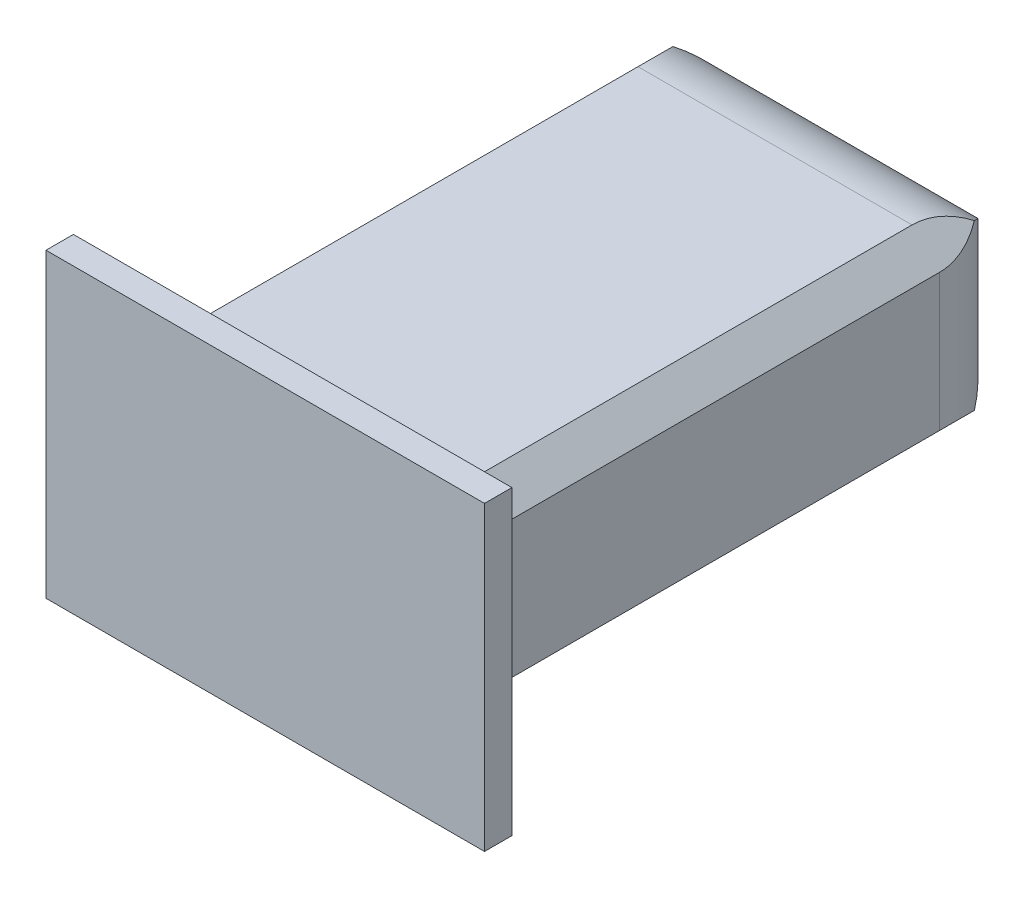
ISO-10303-21;
HEADER;
FILE_DESCRIPTION(('STEP AP214'),'2;1');
FILE_NAME('part.step','',(''),(''),'','','');
FILE_SCHEMA(('AUTOMOTIVE_DESIGN { 1 0 10303 214 1 1 1 1 }'));
ENDSEC;
DATA;
#1=APPLICATION_CONTEXT('core data for automotive mechanical design processes');
#2=APPLICATION_PROTOCOL_DEFINITION('international standard','automotive_design',2000,#1);
#3=PRODUCT_CONTEXT('',#1,'mechanical');
#4=PRODUCT('Part','Part','',(#3));
#5=PRODUCT_RELATED_PRODUCT_CATEGORY('part','',(#4));
#6=PRODUCT_DEFINITION_FORMATION('','',#4);
#7=PRODUCT_DEFINITION_CONTEXT('part definition',#1,'design');
#8=PRODUCT_DEFINITION('design','',#6,#7);
#9=PRODUCT_DEFINITION_SHAPE('','',#8);
#10=(LENGTH_UNIT() NAMED_UNIT(*) SI_UNIT(.MILLI.,.METRE.));
#11=(NAMED_UNIT(*) PLANE_ANGLE_UNIT() SI_UNIT($,.RADIAN.));
#12=(NAMED_UNIT(*) SI_UNIT($,.STERADIAN.) SOLID_ANGLE_UNIT());
#13=UNCERTAINTY_MEASURE_WITH_UNIT(LENGTH_MEASURE(1.E-05),#10,'distance_accuracy_value','');
#14=(GEOMETRIC_REPRESENTATION_CONTEXT(3) GLOBAL_UNCERTAINTY_ASSIGNED_CONTEXT((#13)) GLOBAL_UNIT_ASSIGNED_CONTEXT((#10,
#11,#12)) REPRESENTATION_CONTEXT('',''));
#15=CARTESIAN_POINT('',(0.,0.,0.));
#16=DIRECTION('',(0.,0.,1.));
#17=DIRECTION('',(1.,0.,0.));
#18=AXIS2_PLACEMENT_3D('',#15,#16,#17);
#19=CARTESIAN_POINT('',(1.5,0.875000000000001,5.));
#20=DIRECTION('',(-1.,0.,0.));
#21=DIRECTION('',(0.,0.,1.));
#22=AXIS2_PLACEMENT_3D('',#19,#20,#21);
#23=PLANE('',#22);
#24=DIRECTION('',(0.,0.,-1.));
#25=VECTOR('',#24,1.);
#26=CARTESIAN_POINT('',(1.5,-0.625000000000001,5.));
#27=LINE('',#26,#25);
#28=CARTESIAN_POINT('',(1.5,-0.625000000000001,5.));
#29=VERTEX_POINT('',#28);
#30=CARTESIAN_POINT('',(1.5,-0.625000000000001,0.85));
#31=VERTEX_POINT('',#30);
#32=EDGE_CURVE('E250',#29,#31,#27,.T.);
#33=ORIENTED_EDGE('',*,*,#32,.T.);
#34=DIRECTION('',(0.,1.,0.));
#35=VECTOR('',#34,1.);
#36=CARTESIAN_POINT('',(1.5,0.875000000000001,0.85));
#37=LINE('',#36,#35);
#38=CARTESIAN_POINT('',(1.5,0.625000000000001,0.85));
#39=VERTEX_POINT('',#38);
#40=EDGE_CURVE('E290',#31,#39,#37,.T.);
#41=ORIENTED_EDGE('',*,*,#40,.T.);
#42=DIRECTION('',(0.,0.,1.));
#43=VECTOR('',#42,1.);
#44=CARTESIAN_POINT('',(1.5,0.625000000000001,5.));
#45=LINE('',#44,#43);
#46=CARTESIAN_POINT('',(1.5,0.625000000000001,5.));
#47=VERTEX_POINT('',#46);
#48=EDGE_CURVE('E247',#39,#47,#45,.T.);
#49=ORIENTED_EDGE('',*,*,#48,.T.);
#50=DIRECTION('',(0.,1.,0.));
#51=VECTOR('',#50,1.);
#52=CARTESIAN_POINT('',(1.5,0.875000000000001,5.));
#53=LINE('',#52,#51);
#54=EDGE_CURVE('E205',#29,#47,#53,.T.);
#55=ORIENTED_EDGE('',*,*,#54,.F.);
#56=EDGE_LOOP('',(#33,#41,#49,#55));
#57=FACE_BOUND('',#56,.T.);
#58=ADVANCED_FACE('F49',(#57),#23,.F.);
#59=CARTESIAN_POINT('',(-1.5,0.875000000000001,5.));
#60=DIRECTION('',(0.,-1.,0.));
#61=DIRECTION('',(0.,0.,-1.));
#62=AXIS2_PLACEMENT_3D('',#59,#60,#61);
#63=PLANE('',#62);
#64=DIRECTION('',(0.,0.,-1.));
#65=VECTOR('',#64,1.);
#66=CARTESIAN_POINT('',(1.25,0.875000000000001,5.));
#67=LINE('',#66,#65);
#68=CARTESIAN_POINT('',(1.25,0.875000000000001,5.));
#69=VERTEX_POINT('',#68);
#70=CARTESIAN_POINT('',(1.25,0.875000000000001,0.85));
#71=VERTEX_POINT('',#70);
#72=EDGE_CURVE('E240',#69,#71,#67,.T.);
#73=ORIENTED_EDGE('',*,*,#72,.T.);
#74=DIRECTION('',(-1.,0.,0.));
#75=VECTOR('',#74,1.);
#76=CARTESIAN_POINT('',(-1.5,0.875000000000001,0.85));
#77=LINE('',#76,#75);
#78=CARTESIAN_POINT('',(-1.25,0.875000000000001,0.85));
#79=VERTEX_POINT('',#78);
#80=EDGE_CURVE('E332',#71,#79,#77,.T.);
#81=ORIENTED_EDGE('',*,*,#80,.T.);
#82=DIRECTION('',(0.,0.,1.));
#83=VECTOR('',#82,1.);
#84=CARTESIAN_POINT('',(-1.25,0.875000000000001,5.));
#85=LINE('',#84,#83);
#86=CARTESIAN_POINT('',(-1.25,0.875000000000001,5.));
#87=VERTEX_POINT('',#86);
#88=EDGE_CURVE('E244',#79,#87,#85,.T.);
#89=ORIENTED_EDGE('',*,*,#88,.T.);
#90=DIRECTION('',(-1.,0.,0.));
#91=VECTOR('',#90,1.);
#92=CARTESIAN_POINT('',(-1.5,0.875000000000001,5.));
#93=LINE('',#92,#91);
#94=EDGE_CURVE('E210',#69,#87,#93,.T.);
#95=ORIENTED_EDGE('',*,*,#94,.F.);
#96=EDGE_LOOP('',(#73,#81,#89,#95));
#97=FACE_BOUND('',#96,.T.);
#98=ADVANCED_FACE('F389',(#97),#63,.F.);
#99=CARTESIAN_POINT('',(-1.5,0.875000000000001,5.));
#100=DIRECTION('',(1.,0.,0.));
#101=DIRECTION('',(0.,0.,-1.));
#102=AXIS2_PLACEMENT_3D('',#99,#100,#101);
#103=PLANE('',#102);
#104=DIRECTION('',(0.,0.,-1.));
#105=VECTOR('',#104,1.);
#106=CARTESIAN_POINT('',(-1.5,0.625000000000001,5.));
#107=LINE('',#106,#105);
#108=CARTESIAN_POINT('',(-1.5,0.625000000000001,5.));
#109=VERTEX_POINT('',#108);
#110=CARTESIAN_POINT('',(-1.5,0.625000000000001,0.85));
#111=VERTEX_POINT('',#110);
#112=EDGE_CURVE('E233',#109,#111,#107,.T.);
#113=ORIENTED_EDGE('',*,*,#112,.T.);
#114=DIRECTION('',(0.,-1.,0.));
#115=VECTOR('',#114,1.);
#116=CARTESIAN_POINT('',(-1.5,0.875000000000001,0.85));
#117=LINE('',#116,#115);
#118=CARTESIAN_POINT('',(-1.5,-0.625000000000001,0.85));
#119=VERTEX_POINT('',#118);
#120=EDGE_CURVE('E341',#111,#119,#117,.T.);
#121=ORIENTED_EDGE('',*,*,#120,.T.);
#122=DIRECTION('',(0.,0.,1.));
#123=VECTOR('',#122,1.);
#124=CARTESIAN_POINT('',(-1.5,-0.625000000000001,5.));
#125=LINE('',#124,#123);
#126=CARTESIAN_POINT('',(-1.5,-0.625000000000001,5.));
#127=VERTEX_POINT('',#126);
#128=EDGE_CURVE('E237',#119,#127,#125,.T.);
#129=ORIENTED_EDGE('',*,*,#128,.T.);
#130=DIRECTION('',(0.,-1.,0.));
#131=VECTOR('',#130,1.);
#132=CARTESIAN_POINT('',(-1.5,0.875000000000001,5.));
#133=LINE('',#132,#131);
#134=EDGE_CURVE('E219',#109,#127,#133,.T.);
#135=ORIENTED_EDGE('',*,*,#134,.F.);
#136=EDGE_LOOP('',(#113,#121,#129,#135));
#137=FACE_BOUND('',#136,.T.);
#138=ADVANCED_FACE('F399',(#137),#103,.F.);
#139=CARTESIAN_POINT('',(-1.5,-0.875000000000001,5.));
#140=DIRECTION('',(0.,1.,0.));
#141=DIRECTION('',(0.,0.,1.));
#142=AXIS2_PLACEMENT_3D('',#139,#140,#141);
#143=PLANE('',#142);
#144=DIRECTION('',(0.,0.,-1.));
#145=VECTOR('',#144,1.);
#146=CARTESIAN_POINT('',(-1.25,-0.875000000000001,5.));
#147=LINE('',#146,#145);
#148=CARTESIAN_POINT('',(-1.25,-0.875000000000001,5.));
#149=VERTEX_POINT('',#148);
#150=CARTESIAN_POINT('',(-1.25,-0.875000000000001,0.85));
#151=VERTEX_POINT('',#150);
#152=EDGE_CURVE('E230',#149,#151,#147,.T.);
#153=ORIENTED_EDGE('',*,*,#152,.T.);
#154=DIRECTION('',(1.,0.,0.));
#155=VECTOR('',#154,1.);
#156=CARTESIAN_POINT('',(-1.5,-0.875000000000001,0.85));
#157=LINE('',#156,#155);
#158=CARTESIAN_POINT('',(1.25,-0.875000000000001,0.85));
#159=VERTEX_POINT('',#158);
#160=EDGE_CURVE('E11',#151,#159,#157,.T.);
#161=ORIENTED_EDGE('',*,*,#160,.T.);
#162=DIRECTION('',(0.,0.,1.));
#163=VECTOR('',#162,1.);
#164=CARTESIAN_POINT('',(1.25,-0.875000000000001,5.));
#165=LINE('',#164,#163);
#166=CARTESIAN_POINT('',(1.25,-0.875000000000001,5.));
#167=VERTEX_POINT('',#166);
#168=EDGE_CURVE('E227',#159,#167,#165,.T.);
#169=ORIENTED_EDGE('',*,*,#168,.T.);
#170=DIRECTION('',(1.,0.,0.));
#171=VECTOR('',#170,1.);
#172=CARTESIAN_POINT('',(-1.5,-0.875000000000001,5.));
#173=LINE('',#172,#171);
#174=EDGE_CURVE('E223',#149,#167,#173,.T.);
#175=ORIENTED_EDGE('',*,*,#174,.F.);
#176=EDGE_LOOP('',(#153,#161,#169,#175));
#177=FACE_BOUND('',#176,.T.);
#178=ADVANCED_FACE('F404',(#177),#143,.F.);
#179=CARTESIAN_POINT('',(0.,0.,0.));
#180=DIRECTION('',(0.,0.,1.));
#181=DIRECTION('',(1.,0.,0.));
#182=AXIS2_PLACEMENT_3D('',#179,#180,#181);
#183=PLANE('',#182);
#184=DIRECTION('',(-1.,0.,0.));
#185=VECTOR('',#184,1.);
#186=CARTESIAN_POINT('',(0.,0.0250000000000011,0.));
#187=LINE('',#186,#185);
#188=CARTESIAN_POINT('',(-0.65,0.0250000000000011,0.));
#189=VERTEX_POINT('',#188);
#190=CARTESIAN_POINT('',(0.65,0.0250000000000011,0.));
#191=VERTEX_POINT('',#190);
#192=EDGE_CURVE('E319',#189,#191,#187,.F.);
#193=ORIENTED_EDGE('',*,*,#192,.T.);
#194=DIRECTION('',(0.,1.,0.));
#195=VECTOR('',#194,1.);
#196=CARTESIAN_POINT('',(0.65,0.,0.));
#197=LINE('',#196,#195);
#198=CARTESIAN_POINT('',(0.65,-0.0250000000000011,0.));
#199=VERTEX_POINT('',#198);
#200=EDGE_CURVE('E322',#191,#199,#197,.F.);
#201=ORIENTED_EDGE('',*,*,#200,.T.);
#202=DIRECTION('',(1.,0.,0.));
#203=VECTOR('',#202,1.);
#204=CARTESIAN_POINT('',(0.,-0.0250000000000011,0.));
#205=LINE('',#204,#203);
#206=CARTESIAN_POINT('',(-0.65,-0.0250000000000011,0.));
#207=VERTEX_POINT('',#206);
#208=EDGE_CURVE('E313',#199,#207,#205,.F.);
#209=ORIENTED_EDGE('',*,*,#208,.T.);
#210=DIRECTION('',(0.,-1.,0.));
#211=VECTOR('',#210,1.);
#212=CARTESIAN_POINT('',(-0.65,0.,0.));
#213=LINE('',#212,#211);
#214=EDGE_CURVE('E316',#207,#189,#213,.F.);
#215=ORIENTED_EDGE('',*,*,#214,.T.);
#216=EDGE_LOOP('',(#193,#201,#209,#215));
#217=FACE_BOUND('',#216,.T.);
#218=ADVANCED_FACE('F373',(#217),#183,.F.);
#219=CARTESIAN_POINT('',(0.,0.,5.));
#220=DIRECTION('',(0.,0.,1.));
#221=DIRECTION('',(1.,0.,0.));
#222=AXIS2_PLACEMENT_3D('',#219,#220,#221);
#223=PLANE('',#222);
#224=DIRECTION('',(1.,0.,0.));
#225=VECTOR('',#224,1.);
#226=CARTESIAN_POINT('',(0.,1.125,5.));
#227=LINE('',#226,#225);
#228=CARTESIAN_POINT('',(-1.75,1.125,5.));
#229=VERTEX_POINT('',#228);
#230=CARTESIAN_POINT('',(1.75,1.125,5.));
#231=VERTEX_POINT('',#230);
#232=EDGE_CURVE('E257',#229,#231,#227,.T.);
#233=ORIENTED_EDGE('',*,*,#232,.T.);
#234=DIRECTION('',(0.,-1.,0.));
#235=VECTOR('',#234,1.);
#236=CARTESIAN_POINT('',(1.75,0.,5.));
#237=LINE('',#236,#235);
#238=CARTESIAN_POINT('',(1.75,-1.125,5.));
#239=VERTEX_POINT('',#238);
#240=EDGE_CURVE('E266',#231,#239,#237,.T.);
#241=ORIENTED_EDGE('',*,*,#240,.T.);
#242=DIRECTION('',(-1.,0.,0.));
#243=VECTOR('',#242,1.);
#244=CARTESIAN_POINT('',(0.,-1.125,5.));
#245=LINE('',#244,#243);
#246=CARTESIAN_POINT('',(-1.75,-1.125,5.));
#247=VERTEX_POINT('',#246);
#248=EDGE_CURVE('E263',#239,#247,#245,.T.);
#249=ORIENTED_EDGE('',*,*,#248,.T.);
#250=DIRECTION('',(0.,1.,0.));
#251=VECTOR('',#250,1.);
#252=CARTESIAN_POINT('',(-1.75,0.,5.));
#253=LINE('',#252,#251);
#254=EDGE_CURVE('E260',#247,#229,#253,.T.);
#255=ORIENTED_EDGE('',*,*,#254,.T.);
#256=EDGE_LOOP('',(#233,#241,#249,#255));
#257=FACE_BOUND('',#256,.T.);
#258=ORIENTED_EDGE('',*,*,#134,.T.);
#259=DIRECTION('',(-0.707106781186546,0.707106781186549,0.));
#260=VECTOR('',#259,1.);
#261=CARTESIAN_POINT('',(-1.0625,-1.0625,5.));
#262=LINE('',#261,#260);
#263=EDGE_CURVE('E278',#127,#149,#262,.F.);
#264=ORIENTED_EDGE('',*,*,#263,.T.);
#265=ORIENTED_EDGE('',*,*,#174,.T.);
#266=DIRECTION('',(-0.707106781186549,-0.707106781186546,0.));
#267=VECTOR('',#266,1.);
#268=CARTESIAN_POINT('',(1.0625,-1.0625,5.));
#269=LINE('',#268,#267);
#270=EDGE_CURVE('E284',#167,#29,#269,.F.);
#271=ORIENTED_EDGE('',*,*,#270,.T.);
#272=ORIENTED_EDGE('',*,*,#54,.T.);
#273=DIRECTION('',(0.707106781186546,-0.707106781186549,0.));
#274=VECTOR('',#273,1.);
#275=CARTESIAN_POINT('',(1.0625,1.0625,5.));
#276=LINE('',#275,#274);
#277=EDGE_CURVE('E287',#47,#69,#276,.F.);
#278=ORIENTED_EDGE('',*,*,#277,.T.);
#279=ORIENTED_EDGE('',*,*,#94,.T.);
#280=DIRECTION('',(0.707106781186549,0.707106781186546,0.));
#281=VECTOR('',#280,1.);
#282=CARTESIAN_POINT('',(-1.0625,1.0625,5.));
#283=LINE('',#282,#281);
#284=EDGE_CURVE('E281',#87,#109,#283,.F.);
#285=ORIENTED_EDGE('',*,*,#284,.T.);
#286=EDGE_LOOP('',(#258,#264,#265,#271,#272,#278,#279,#285));
#287=FACE_BOUND('',#286,.T.);
#288=ADVANCED_FACE('F393',(#257,#287),#223,.F.);
#289=CARTESIAN_POINT('',(0.,-1.375,5.5));
#290=DIRECTION('',(0.,1.,0.));
#291=DIRECTION('',(0.,0.,1.));
#292=AXIS2_PLACEMENT_3D('',#289,#290,#291);
#293=PLANE('',#292);
#294=DIRECTION('',(0.,0.,-1.));
#295=VECTOR('',#294,1.);
#296=CARTESIAN_POINT('',(-2.,-1.375,5.5));
#297=LINE('',#296,#295);
#298=CARTESIAN_POINT('',(-2.,-1.375,5.5));
#299=VERTEX_POINT('',#298);
#300=CARTESIAN_POINT('',(-2.,-1.375,5.25));
#301=VERTEX_POINT('',#300);
#302=EDGE_CURVE('E637',#299,#301,#297,.T.);
#303=ORIENTED_EDGE('',*,*,#302,.T.);
#304=DIRECTION('',(1.,0.,0.));
#305=VECTOR('',#304,1.);
#306=CARTESIAN_POINT('',(0.,-1.375,5.25));
#307=LINE('',#306,#305);
#308=CARTESIAN_POINT('',(2.,-1.375,5.25));
#309=VERTEX_POINT('',#308);
#310=EDGE_CURVE('E203',#301,#309,#307,.T.);
#311=ORIENTED_EDGE('',*,*,#310,.T.);
#312=DIRECTION('',(0.,0.,-1.));
#313=VECTOR('',#312,1.);
#314=CARTESIAN_POINT('',(2.,-1.375,5.5));
#315=LINE('',#314,#313);
#316=CARTESIAN_POINT('',(2.,-1.375,5.5));
#317=VERTEX_POINT('',#316);
#318=EDGE_CURVE('E181',#317,#309,#315,.T.);
#319=ORIENTED_EDGE('',*,*,#318,.F.);
#320=DIRECTION('',(1.,0.,0.));
#321=VECTOR('',#320,1.);
#322=CARTESIAN_POINT('',(0.,-1.375,5.5));
#323=LINE('',#322,#321);
#324=EDGE_CURVE('E189',#299,#317,#323,.T.);
#325=ORIENTED_EDGE('',*,*,#324,.F.);
#326=EDGE_LOOP('',(#303,#311,#319,#325));
#327=FACE_BOUND('',#326,.T.);
#328=ADVANCED_FACE('F201',(#327),#293,.F.);
#329=CARTESIAN_POINT('',(2.,0.,5.5));
#330=DIRECTION('',(-1.,0.,0.));
#331=DIRECTION('',(0.,0.,1.));
#332=AXIS2_PLACEMENT_3D('',#329,#330,#331);
#333=PLANE('',#332);
#334=ORIENTED_EDGE('',*,*,#318,.T.);
#335=DIRECTION('',(0.,1.,0.));
#336=VECTOR('',#335,1.);
#337=CARTESIAN_POINT('',(2.,0.,5.25));
#338=LINE('',#337,#336);
#339=CARTESIAN_POINT('',(2.,1.375,5.25));
#340=VERTEX_POINT('',#339);
#341=EDGE_CURVE('E254',#309,#340,#338,.T.);
#342=ORIENTED_EDGE('',*,*,#341,.T.);
#343=DIRECTION('',(0.,0.,-1.));
#344=VECTOR('',#343,1.);
#345=CARTESIAN_POINT('',(2.,1.375,5.5));
#346=LINE('',#345,#344);
#347=CARTESIAN_POINT('',(2.,1.375,5.5));
#348=VERTEX_POINT('',#347);
#349=EDGE_CURVE('E184',#348,#340,#346,.T.);
#350=ORIENTED_EDGE('',*,*,#349,.F.);
#351=DIRECTION('',(0.,1.,0.));
#352=VECTOR('',#351,1.);
#353=CARTESIAN_POINT('',(2.,0.,5.5));
#354=LINE('',#353,#352);
#355=EDGE_CURVE('E176',#317,#348,#354,.T.);
#356=ORIENTED_EDGE('',*,*,#355,.F.);
#357=EDGE_LOOP('',(#334,#342,#350,#356));
#358=FACE_BOUND('',#357,.T.);
#359=ADVANCED_FACE('F178',(#358),#333,.F.);
#360=CARTESIAN_POINT('',(0.,1.375,5.5));
#361=DIRECTION('',(0.,-1.,0.));
#362=DIRECTION('',(0.,0.,-1.));
#363=AXIS2_PLACEMENT_3D('',#360,#361,#362);
#364=PLANE('',#363);
#365=ORIENTED_EDGE('',*,*,#349,.T.);
#366=DIRECTION('',(-1.,0.,0.));
#367=VECTOR('',#366,1.);
#368=CARTESIAN_POINT('',(0.,1.375,5.25));
#369=LINE('',#368,#367);
#370=CARTESIAN_POINT('',(-2.,1.375,5.25));
#371=VERTEX_POINT('',#370);
#372=EDGE_CURVE('E275',#340,#371,#369,.T.);
#373=ORIENTED_EDGE('',*,*,#372,.T.);
#374=DIRECTION('',(0.,0.,-1.));
#375=VECTOR('',#374,1.);
#376=CARTESIAN_POINT('',(-2.,1.375,5.5));
#377=LINE('',#376,#375);
#378=CARTESIAN_POINT('',(-2.,1.375,5.5));
#379=VERTEX_POINT('',#378);
#380=EDGE_CURVE('E212',#379,#371,#377,.T.);
#381=ORIENTED_EDGE('',*,*,#380,.F.);
#382=DIRECTION('',(-1.,0.,0.));
#383=VECTOR('',#382,1.);
#384=CARTESIAN_POINT('',(0.,1.375,5.5));
#385=LINE('',#384,#383);
#386=EDGE_CURVE('E188',#348,#379,#385,.T.);
#387=ORIENTED_EDGE('',*,*,#386,.F.);
#388=EDGE_LOOP('',(#365,#373,#381,#387));
#389=FACE_BOUND('',#388,.T.);
#390=ADVANCED_FACE('F558',(#389),#364,.F.);
#391=CARTESIAN_POINT('',(-2.,0.,5.5));
#392=DIRECTION('',(1.,0.,0.));
#393=DIRECTION('',(0.,0.,-1.));
#394=AXIS2_PLACEMENT_3D('',#391,#392,#393);
#395=PLANE('',#394);
#396=ORIENTED_EDGE('',*,*,#380,.T.);
#397=DIRECTION('',(0.,-1.,0.));
#398=VECTOR('',#397,1.);
#399=CARTESIAN_POINT('',(-2.,0.,5.25));
#400=LINE('',#399,#398);
#401=EDGE_CURVE('E272',#371,#301,#400,.T.);
#402=ORIENTED_EDGE('',*,*,#401,.T.);
#403=ORIENTED_EDGE('',*,*,#302,.F.);
#404=DIRECTION('',(0.,-1.,0.));
#405=VECTOR('',#404,1.);
#406=CARTESIAN_POINT('',(-2.,0.,5.5));
#407=LINE('',#406,#405);
#408=EDGE_CURVE('E194',#379,#299,#407,.T.);
#409=ORIENTED_EDGE('',*,*,#408,.F.);
#410=EDGE_LOOP('',(#396,#402,#403,#409));
#411=FACE_BOUND('',#410,.T.);
#412=ADVANCED_FACE('F566',(#411),#395,.F.);
#413=CARTESIAN_POINT('',(0.,0.,5.5));
#414=DIRECTION('',(0.,0.,1.));
#415=DIRECTION('',(1.,0.,0.));
#416=AXIS2_PLACEMENT_3D('',#413,#414,#415);
#417=PLANE('',#416);
#418=ORIENTED_EDGE('',*,*,#324,.T.);
#419=ORIENTED_EDGE('',*,*,#355,.T.);
#420=ORIENTED_EDGE('',*,*,#386,.T.);
#421=ORIENTED_EDGE('',*,*,#408,.T.);
#422=EDGE_LOOP('',(#418,#419,#420,#421));
#423=FACE_BOUND('',#422,.T.);
#424=ADVANCED_FACE('F192',(#423),#417,.T.);
#425=CARTESIAN_POINT('',(-1.25,-0.875000000000001,5.));
#426=DIRECTION('',(0.707106781186549,0.707106781186546,0.));
#427=DIRECTION('',(0.,0.,-1.));
#428=AXIS2_PLACEMENT_3D('',#425,#426,#427);
#429=PLANE('',#428);
#430=ORIENTED_EDGE('',*,*,#128,.F.);
#431=CARTESIAN_POINT('',(-0.65,-1.475,0.85));
#432=DIRECTION('',(0.707106781186549,0.707106781186546,0.));
#433=DIRECTION('',(0.707106781186546,-0.707106781186549,0.));
#434=AXIS2_PLACEMENT_3D('',#431,#432,#433);
#435=ELLIPSE('',#434,1.20208152801713,0.85);
#436=CARTESIAN_POINT('',(-1.375,-0.750000000000001,0.406294016267529));
#437=VERTEX_POINT('',#436);
#438=EDGE_CURVE('E59',#119,#437,#435,.F.);
#439=ORIENTED_EDGE('',*,*,#438,.T.);
#440=CARTESIAN_POINT('',(-2.1,-0.0250000000000011,0.85));
#441=DIRECTION('',(0.707106781186549,0.707106781186546,0.));
#442=DIRECTION('',(0.707106781186546,-0.707106781186549,0.));
#443=AXIS2_PLACEMENT_3D('',#440,#441,#442);
#444=ELLIPSE('',#443,1.20208152801713,0.85);
#445=EDGE_CURVE('E71',#437,#151,#444,.F.);
#446=ORIENTED_EDGE('',*,*,#445,.T.);
#447=ORIENTED_EDGE('',*,*,#152,.F.);
#448=ORIENTED_EDGE('',*,*,#263,.F.);
#449=EDGE_LOOP('',(#430,#439,#446,#447,#448));
#450=FACE_BOUND('',#449,.T.);
#451=ADVANCED_FACE('F402',(#450),#429,.F.);
#452=CARTESIAN_POINT('',(-1.5,0.625000000000001,5.));
#453=DIRECTION('',(0.707106781186546,-0.707106781186549,0.));
#454=DIRECTION('',(0.,0.,-1.));
#455=AXIS2_PLACEMENT_3D('',#452,#453,#454);
#456=PLANE('',#455);
#457=ORIENTED_EDGE('',*,*,#88,.F.);
#458=CARTESIAN_POINT('',(-2.1,0.0250000000000011,0.85));
#459=DIRECTION('',(0.707106781186546,-0.707106781186549,0.));
#460=DIRECTION('',(-0.707106781186549,-0.707106781186546,0.));
#461=AXIS2_PLACEMENT_3D('',#458,#459,#460);
#462=ELLIPSE('',#461,1.20208152801713,0.85);
#463=CARTESIAN_POINT('',(-1.375,0.750000000000001,0.406294016267529));
#464=VERTEX_POINT('',#463);
#465=EDGE_CURVE('E338',#79,#464,#462,.F.);
#466=ORIENTED_EDGE('',*,*,#465,.T.);
#467=CARTESIAN_POINT('',(-0.65,1.475,0.85));
#468=DIRECTION('',(0.707106781186546,-0.707106781186549,0.));
#469=DIRECTION('',(-0.707106781186549,-0.707106781186546,0.));
#470=AXIS2_PLACEMENT_3D('',#467,#468,#469);
#471=ELLIPSE('',#470,1.20208152801713,0.85);
#472=EDGE_CURVE('E335',#464,#111,#471,.F.);
#473=ORIENTED_EDGE('',*,*,#472,.T.);
#474=ORIENTED_EDGE('',*,*,#112,.F.);
#475=ORIENTED_EDGE('',*,*,#284,.F.);
#476=EDGE_LOOP('',(#457,#466,#473,#474,#475));
#477=FACE_BOUND('',#476,.T.);
#478=ADVANCED_FACE('F397',(#477),#456,.F.);
#479=CARTESIAN_POINT('',(1.5,-0.625000000000001,5.));
#480=DIRECTION('',(-0.707106781186546,0.707106781186549,0.));
#481=DIRECTION('',(0.,0.,-1.));
#482=AXIS2_PLACEMENT_3D('',#479,#480,#481);
#483=PLANE('',#482);
#484=CARTESIAN_POINT('',(2.1,-0.0250000000000011,0.85));
#485=DIRECTION('',(-0.707106781186546,0.707106781186549,0.));
#486=DIRECTION('',(0.707106781186549,0.707106781186546,0.));
#487=AXIS2_PLACEMENT_3D('',#484,#485,#486);
#488=ELLIPSE('',#487,1.20208152801713,0.85);
#489=CARTESIAN_POINT('',(1.375,-0.750000000000001,0.406294016267528));
#490=VERTEX_POINT('',#489);
#491=EDGE_CURVE('E326',#159,#490,#488,.F.);
#492=ORIENTED_EDGE('',*,*,#491,.T.);
#493=CARTESIAN_POINT('',(0.65,-1.475,0.85));
#494=DIRECTION('',(-0.707106781186546,0.707106781186549,0.));
#495=DIRECTION('',(0.707106781186549,0.707106781186546,0.));
#496=AXIS2_PLACEMENT_3D('',#493,#494,#495);
#497=ELLIPSE('',#496,1.20208152801713,0.85);
#498=EDGE_CURVE('E329',#490,#31,#497,.F.);
#499=ORIENTED_EDGE('',*,*,#498,.T.);
#500=ORIENTED_EDGE('',*,*,#32,.F.);
#501=ORIENTED_EDGE('',*,*,#270,.F.);
#502=ORIENTED_EDGE('',*,*,#168,.F.);
#503=EDGE_LOOP('',(#492,#499,#500,#501,#502));
#504=FACE_BOUND('',#503,.T.);
#505=ADVANCED_FACE('F408',(#504),#483,.F.);
#506=CARTESIAN_POINT('',(1.25,0.875000000000001,5.));
#507=DIRECTION('',(-0.707106781186549,-0.707106781186546,0.));
#508=DIRECTION('',(0.,0.,-1.));
#509=AXIS2_PLACEMENT_3D('',#506,#507,#508);
#510=PLANE('',#509);
#511=ORIENTED_EDGE('',*,*,#48,.F.);
#512=CARTESIAN_POINT('',(0.65,1.475,0.85));
#513=DIRECTION('',(-0.707106781186549,-0.707106781186546,0.));
#514=DIRECTION('',(-0.707106781186546,0.707106781186549,0.));
#515=AXIS2_PLACEMENT_3D('',#512,#513,#514);
#516=ELLIPSE('',#515,1.20208152801713,0.85);
#517=CARTESIAN_POINT('',(1.375,0.750000000000001,0.406294016267529));
#518=VERTEX_POINT('',#517);
#519=EDGE_CURVE('E310',#39,#518,#516,.F.);
#520=ORIENTED_EDGE('',*,*,#519,.T.);
#521=CARTESIAN_POINT('',(2.1,0.0250000000000011,0.85));
#522=DIRECTION('',(-0.707106781186549,-0.707106781186546,0.));
#523=DIRECTION('',(-0.707106781186546,0.707106781186549,0.));
#524=AXIS2_PLACEMENT_3D('',#521,#522,#523);
#525=ELLIPSE('',#524,1.20208152801713,0.85);
#526=EDGE_CURVE('E307',#518,#71,#525,.F.);
#527=ORIENTED_EDGE('',*,*,#526,.T.);
#528=ORIENTED_EDGE('',*,*,#72,.F.);
#529=ORIENTED_EDGE('',*,*,#277,.F.);
#530=EDGE_LOOP('',(#511,#520,#527,#528,#529));
#531=FACE_BOUND('',#530,.T.);
#532=ADVANCED_FACE('F385',(#531),#510,.F.);
#533=CARTESIAN_POINT('',(-2.,0.,5.25));
#534=DIRECTION('',(0.707106781186546,0.,0.707106781186549));
#535=DIRECTION('',(0.,-1.,0.));
#536=AXIS2_PLACEMENT_3D('',#533,#534,#535);
#537=PLANE('',#536);
#538=DIRECTION('',(-0.577350269189626,0.577350269189626,0.577350269189624));
#539=VECTOR('',#538,1.);
#540=CARTESIAN_POINT('',(-1.33333333333333,0.708333333333333,4.58333333333333));
#541=LINE('',#540,#539);
#542=EDGE_CURVE('E297',#229,#371,#541,.T.);
#543=ORIENTED_EDGE('',*,*,#542,.F.);
#544=ORIENTED_EDGE('',*,*,#254,.F.);
#545=DIRECTION('',(-0.577350269189626,-0.577350269189626,0.577350269189624));
#546=VECTOR('',#545,1.);
#547=CARTESIAN_POINT('',(-1.54166666666667,-0.916666666666666,4.79166666666667));
#548=LINE('',#547,#546);
#549=EDGE_CURVE('E199',#301,#247,#548,.F.);
#550=ORIENTED_EDGE('',*,*,#549,.F.);
#551=ORIENTED_EDGE('',*,*,#401,.F.);
#552=EDGE_LOOP('',(#543,#544,#550,#551));
#553=FACE_BOUND('',#552,.T.);
#554=ADVANCED_FACE('F444',(#553),#537,.F.);
#555=CARTESIAN_POINT('',(0.,-1.375,5.25));
#556=DIRECTION('',(0.,0.707106781186546,0.707106781186549));
#557=DIRECTION('',(1.,0.,0.));
#558=AXIS2_PLACEMENT_3D('',#555,#556,#557);
#559=PLANE('',#558);
#560=ORIENTED_EDGE('',*,*,#549,.T.);
#561=ORIENTED_EDGE('',*,*,#248,.F.);
#562=DIRECTION('',(0.577350269189626,-0.577350269189626,0.577350269189624));
#563=VECTOR('',#562,1.);
#564=CARTESIAN_POINT('',(1.33333333333333,-0.708333333333333,4.58333333333333));
#565=LINE('',#564,#563);
#566=EDGE_CURVE('E294',#309,#239,#565,.F.);
#567=ORIENTED_EDGE('',*,*,#566,.F.);
#568=ORIENTED_EDGE('',*,*,#310,.F.);
#569=EDGE_LOOP('',(#560,#561,#567,#568));
#570=FACE_BOUND('',#569,.T.);
#571=ADVANCED_FACE('F458',(#570),#559,.F.);
#572=CARTESIAN_POINT('',(0.,1.375,5.25));
#573=DIRECTION('',(0.,-0.707106781186546,0.707106781186549));
#574=DIRECTION('',(-1.,0.,0.));
#575=AXIS2_PLACEMENT_3D('',#572,#573,#574);
#576=PLANE('',#575);
#577=ORIENTED_EDGE('',*,*,#542,.T.);
#578=ORIENTED_EDGE('',*,*,#372,.F.);
#579=DIRECTION('',(-0.577350269189626,-0.577350269189626,-0.577350269189624));
#580=VECTOR('',#579,1.);
#581=CARTESIAN_POINT('',(1.33333333333333,0.708333333333333,4.58333333333333));
#582=LINE('',#581,#580);
#583=EDGE_CURVE('E291',#231,#340,#582,.F.);
#584=ORIENTED_EDGE('',*,*,#583,.F.);
#585=ORIENTED_EDGE('',*,*,#232,.F.);
#586=EDGE_LOOP('',(#577,#578,#584,#585));
#587=FACE_BOUND('',#586,.T.);
#588=ADVANCED_FACE('F451',(#587),#576,.F.);
#589=CARTESIAN_POINT('',(2.,0.,5.25));
#590=DIRECTION('',(-0.707106781186546,0.,0.707106781186549));
#591=DIRECTION('',(0.,1.,0.));
#592=AXIS2_PLACEMENT_3D('',#589,#590,#591);
#593=PLANE('',#592);
#594=ORIENTED_EDGE('',*,*,#566,.T.);
#595=ORIENTED_EDGE('',*,*,#240,.F.);
#596=ORIENTED_EDGE('',*,*,#583,.T.);
#597=ORIENTED_EDGE('',*,*,#341,.F.);
#598=EDGE_LOOP('',(#594,#595,#596,#597));
#599=FACE_BOUND('',#598,.T.);
#600=ADVANCED_FACE('F446',(#599),#593,.F.);
#601=CARTESIAN_POINT('',(-0.65,0.875000000000001,0.85));
#602=DIRECTION('',(0.,-1.,0.));
#603=DIRECTION('',(0.,0.,-1.));
#604=AXIS2_PLACEMENT_3D('',#601,#602,#603);
#605=CYLINDRICAL_SURFACE('',#604,0.85);
#606=CARTESIAN_POINT('',(-0.65,0.0250000000000011,0.85));
#607=DIRECTION('',(-0.707106781186547,-0.707106781186547,0.));
#608=DIRECTION('',(0.707106781186547,-0.707106781186547,0.));
#609=AXIS2_PLACEMENT_3D('',#606,#607,#608);
#610=ELLIPSE('',#609,1.20208152801713,0.85);
#611=EDGE_CURVE('E354',#189,#464,#610,.F.);
#612=ORIENTED_EDGE('',*,*,#611,.F.);
#613=ORIENTED_EDGE('',*,*,#214,.F.);
#614=CARTESIAN_POINT('',(-0.65,-0.0250000000000011,0.85));
#615=DIRECTION('',(0.707106781186547,-0.707106781186547,0.));
#616=DIRECTION('',(0.707106781186547,0.707106781186547,0.));
#617=AXIS2_PLACEMENT_3D('',#614,#615,#616);
#618=ELLIPSE('',#617,1.20208152801713,0.85);
#619=EDGE_CURVE('E53',#437,#207,#618,.T.);
#620=ORIENTED_EDGE('',*,*,#619,.F.);
#621=ORIENTED_EDGE('',*,*,#438,.F.);
#622=ORIENTED_EDGE('',*,*,#120,.F.);
#623=ORIENTED_EDGE('',*,*,#472,.F.);
#624=EDGE_LOOP('',(#612,#613,#620,#621,#622,#623));
#625=FACE_BOUND('',#624,.T.);
#626=ADVANCED_FACE('F51',(#625),#605,.T.);
#627=CARTESIAN_POINT('',(-1.5,-0.0250000000000011,0.85));
#628=DIRECTION('',(1.,0.,0.));
#629=DIRECTION('',(0.,0.,-1.));
#630=AXIS2_PLACEMENT_3D('',#627,#628,#629);
#631=CYLINDRICAL_SURFACE('',#630,0.85);
#632=ORIENTED_EDGE('',*,*,#619,.T.);
#633=ORIENTED_EDGE('',*,*,#208,.F.);
#634=CARTESIAN_POINT('',(0.65,-0.0250000000000011,0.85));
#635=DIRECTION('',(0.707106781186547,0.707106781186547,0.));
#636=DIRECTION('',(0.707106781186547,-0.707106781186547,0.));
#637=AXIS2_PLACEMENT_3D('',#634,#635,#636);
#638=ELLIPSE('',#637,1.20208152801713,0.85);
#639=EDGE_CURVE('E352',#490,#199,#638,.T.);
#640=ORIENTED_EDGE('',*,*,#639,.F.);
#641=ORIENTED_EDGE('',*,*,#491,.F.);
#642=ORIENTED_EDGE('',*,*,#160,.F.);
#643=ORIENTED_EDGE('',*,*,#445,.F.);
#644=EDGE_LOOP('',(#632,#633,#640,#641,#642,#643));
#645=FACE_BOUND('',#644,.T.);
#646=ADVANCED_FACE('F365',(#645),#631,.T.);
#647=CARTESIAN_POINT('',(-1.5,0.0250000000000011,0.85));
#648=DIRECTION('',(-1.,0.,0.));
#649=DIRECTION('',(0.,0.,1.));
#650=AXIS2_PLACEMENT_3D('',#647,#648,#649);
#651=CYLINDRICAL_SURFACE('',#650,0.85);
#652=ORIENTED_EDGE('',*,*,#80,.F.);
#653=ORIENTED_EDGE('',*,*,#526,.F.);
#654=CARTESIAN_POINT('',(0.65,0.0250000000000011,0.85));
#655=DIRECTION('',(-0.707106781186547,0.707106781186547,0.));
#656=DIRECTION('',(-0.707106781186547,-0.707106781186547,0.));
#657=AXIS2_PLACEMENT_3D('',#654,#655,#656);
#658=ELLIPSE('',#657,1.20208152801713,0.85);
#659=EDGE_CURVE('E348',#191,#518,#658,.F.);
#660=ORIENTED_EDGE('',*,*,#659,.F.);
#661=ORIENTED_EDGE('',*,*,#192,.F.);
#662=ORIENTED_EDGE('',*,*,#611,.T.);
#663=ORIENTED_EDGE('',*,*,#465,.F.);
#664=EDGE_LOOP('',(#652,#653,#660,#661,#662,#663));
#665=FACE_BOUND('',#664,.T.);
#666=ADVANCED_FACE('F381',(#665),#651,.T.);
#667=CARTESIAN_POINT('',(0.65,0.875000000000001,0.85));
#668=DIRECTION('',(0.,1.,0.));
#669=DIRECTION('',(0.,0.,1.));
#670=AXIS2_PLACEMENT_3D('',#667,#668,#669);
#671=CYLINDRICAL_SURFACE('',#670,0.85);
#672=ORIENTED_EDGE('',*,*,#639,.T.);
#673=ORIENTED_EDGE('',*,*,#200,.F.);
#674=ORIENTED_EDGE('',*,*,#659,.T.);
#675=ORIENTED_EDGE('',*,*,#519,.F.);
#676=ORIENTED_EDGE('',*,*,#40,.F.);
#677=ORIENTED_EDGE('',*,*,#498,.F.);
#678=EDGE_LOOP('',(#672,#673,#674,#675,#676,#677));
#679=FACE_BOUND('',#678,.T.);
#680=ADVANCED_FACE('F377',(#679),#671,.T.);
#681=CLOSED_SHELL('',(#58,#98,#138,#178,#218,#288,#328,#359,#390,#412,#424,#451,#478,#505,#532,
#554,#571,#588,#600,#626,#646,#666,#680));
#682=MANIFOLD_SOLID_BREP('B2',#681);
#683=ADVANCED_BREP_SHAPE_REPRESENTATION('',(#18,#682),#14);
#684=SHAPE_DEFINITION_REPRESENTATION(#9,#683);
ENDSEC;
END-ISO-10303-21;
